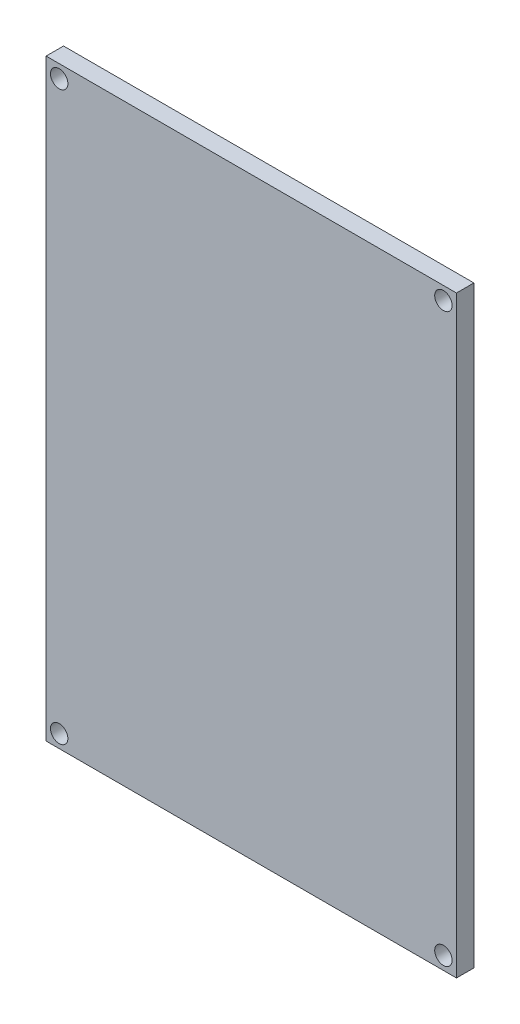
ISO-10303-21;
HEADER;
FILE_DESCRIPTION(('STEP AP214'),'2;1');
FILE_NAME('part.step','',(''),(''),'','','');
FILE_SCHEMA(('AUTOMOTIVE_DESIGN { 1 0 10303 214 1 1 1 1 }'));
ENDSEC;
DATA;
#1=APPLICATION_CONTEXT('core data for automotive mechanical design processes');
#2=APPLICATION_PROTOCOL_DEFINITION('international standard','automotive_design',2000,#1);
#3=PRODUCT_CONTEXT('',#1,'mechanical');
#4=PRODUCT('Part','Part','',(#3));
#5=PRODUCT_RELATED_PRODUCT_CATEGORY('part','',(#4));
#6=PRODUCT_DEFINITION_FORMATION('','',#4);
#7=PRODUCT_DEFINITION_CONTEXT('part definition',#1,'design');
#8=PRODUCT_DEFINITION('design','',#6,#7);
#9=PRODUCT_DEFINITION_SHAPE('','',#8);
#10=(LENGTH_UNIT() NAMED_UNIT(*) SI_UNIT(.MILLI.,.METRE.));
#11=(NAMED_UNIT(*) PLANE_ANGLE_UNIT() SI_UNIT($,.RADIAN.));
#12=(NAMED_UNIT(*) SI_UNIT($,.STERADIAN.) SOLID_ANGLE_UNIT());
#13=UNCERTAINTY_MEASURE_WITH_UNIT(LENGTH_MEASURE(1.E-05),#10,'distance_accuracy_value','');
#14=(GEOMETRIC_REPRESENTATION_CONTEXT(3) GLOBAL_UNCERTAINTY_ASSIGNED_CONTEXT((#13)) GLOBAL_UNIT_ASSIGNED_CONTEXT((#10,
#11,#12)) REPRESENTATION_CONTEXT('',''));
#15=CARTESIAN_POINT('',(0.,0.,0.));
#16=DIRECTION('',(0.,0.,1.));
#17=DIRECTION('',(1.,0.,0.));
#18=AXIS2_PLACEMENT_3D('',#15,#16,#17);
#19=CARTESIAN_POINT('',(0.,0.,3.));
#20=DIRECTION('',(0.,1.,0.));
#21=DIRECTION('',(-1.,0.,0.));
#22=AXIS2_PLACEMENT_3D('',#19,#20,#21);
#23=PLANE('',#22);
#24=DIRECTION('',(1.,0.,0.));
#25=VECTOR('',#24,1.);
#26=CARTESIAN_POINT('',(0.,0.,0.));
#27=LINE('',#26,#25);
#28=CARTESIAN_POINT('',(0.,0.,0.));
#29=VERTEX_POINT('',#28);
#30=CARTESIAN_POINT('',(70.6819805153395,0.,0.));
#31=VERTEX_POINT('',#30);
#32=EDGE_CURVE('E113',#29,#31,#27,.T.);
#33=ORIENTED_EDGE('',*,*,#32,.T.);
#34=DIRECTION('',(0.,0.,-1.));
#35=VECTOR('',#34,1.);
#36=CARTESIAN_POINT('',(70.6819805153395,0.,3.));
#37=LINE('',#36,#35);
#38=CARTESIAN_POINT('',(70.6819805153395,0.,3.));
#39=VERTEX_POINT('',#38);
#40=EDGE_CURVE('E11',#39,#31,#37,.T.);
#41=ORIENTED_EDGE('',*,*,#40,.F.);
#42=DIRECTION('',(1.,0.,0.));
#43=VECTOR('',#42,1.);
#44=CARTESIAN_POINT('',(0.,0.,3.));
#45=LINE('',#44,#43);
#46=CARTESIAN_POINT('',(0.,0.,3.));
#47=VERTEX_POINT('',#46);
#48=EDGE_CURVE('E86',#47,#39,#45,.T.);
#49=ORIENTED_EDGE('',*,*,#48,.F.);
#50=DIRECTION('',(0.,0.,-1.));
#51=VECTOR('',#50,1.);
#52=CARTESIAN_POINT('',(0.,0.,3.));
#53=LINE('',#52,#51);
#54=EDGE_CURVE('E52',#47,#29,#53,.T.);
#55=ORIENTED_EDGE('',*,*,#54,.T.);
#56=EDGE_LOOP('',(#33,#41,#49,#55));
#57=FACE_BOUND('',#56,.T.);
#58=ADVANCED_FACE('F35',(#57),#23,.F.);
#59=CARTESIAN_POINT('',(70.6819805153395,0.,3.));
#60=DIRECTION('',(-1.,0.,0.));
#61=DIRECTION('',(0.,-1.,0.));
#62=AXIS2_PLACEMENT_3D('',#59,#60,#61);
#63=PLANE('',#62);
#64=DIRECTION('',(0.,1.,0.));
#65=VECTOR('',#64,1.);
#66=CARTESIAN_POINT('',(70.6819805153395,0.,0.));
#67=LINE('',#66,#65);
#68=CARTESIAN_POINT('',(70.6819805153395,102.181980515339,0.));
#69=VERTEX_POINT('',#68);
#70=EDGE_CURVE('E91',#31,#69,#67,.T.);
#71=ORIENTED_EDGE('',*,*,#70,.T.);
#72=DIRECTION('',(0.,0.,-1.));
#73=VECTOR('',#72,1.);
#74=CARTESIAN_POINT('',(70.6819805153395,102.181980515339,3.));
#75=LINE('',#74,#73);
#76=CARTESIAN_POINT('',(70.6819805153395,102.181980515339,3.));
#77=VERTEX_POINT('',#76);
#78=EDGE_CURVE('E44',#77,#69,#75,.T.);
#79=ORIENTED_EDGE('',*,*,#78,.F.);
#80=DIRECTION('',(0.,1.,0.));
#81=VECTOR('',#80,1.);
#82=CARTESIAN_POINT('',(70.6819805153395,0.,3.));
#83=LINE('',#82,#81);
#84=EDGE_CURVE('E77',#39,#77,#83,.T.);
#85=ORIENTED_EDGE('',*,*,#84,.F.);
#86=ORIENTED_EDGE('',*,*,#40,.T.);
#87=EDGE_LOOP('',(#71,#79,#85,#86));
#88=FACE_BOUND('',#87,.T.);
#89=ADVANCED_FACE('F90',(#88),#63,.F.);
#90=CARTESIAN_POINT('',(0.,102.181980515339,3.));
#91=DIRECTION('',(0.,1.,0.));
#92=DIRECTION('',(-1.,0.,0.));
#93=AXIS2_PLACEMENT_3D('',#90,#91,#92);
#94=PLANE('',#93);
#95=DIRECTION('',(1.,0.,0.));
#96=VECTOR('',#95,1.);
#97=CARTESIAN_POINT('',(0.,102.181980515339,0.));
#98=LINE('',#97,#96);
#99=CARTESIAN_POINT('',(0.,102.181980515339,0.));
#100=VERTEX_POINT('',#99);
#101=EDGE_CURVE('E116',#100,#69,#98,.T.);
#102=ORIENTED_EDGE('',*,*,#101,.F.);
#103=DIRECTION('',(0.,0.,-1.));
#104=VECTOR('',#103,1.);
#105=CARTESIAN_POINT('',(0.,102.181980515339,3.));
#106=LINE('',#105,#104);
#107=CARTESIAN_POINT('',(0.,102.181980515339,3.));
#108=VERTEX_POINT('',#107);
#109=EDGE_CURVE('E66',#108,#100,#106,.T.);
#110=ORIENTED_EDGE('',*,*,#109,.F.);
#111=DIRECTION('',(1.,0.,0.));
#112=VECTOR('',#111,1.);
#113=CARTESIAN_POINT('',(0.,102.181980515339,3.));
#114=LINE('',#113,#112);
#115=EDGE_CURVE('E85',#108,#77,#114,.T.);
#116=ORIENTED_EDGE('',*,*,#115,.T.);
#117=ORIENTED_EDGE('',*,*,#78,.T.);
#118=EDGE_LOOP('',(#102,#110,#116,#117));
#119=FACE_BOUND('',#118,.T.);
#120=ADVANCED_FACE('F94',(#119),#94,.T.);
#121=CARTESIAN_POINT('',(0.,0.,3.));
#122=DIRECTION('',(-1.,0.,0.));
#123=DIRECTION('',(0.,-1.,0.));
#124=AXIS2_PLACEMENT_3D('',#121,#122,#123);
#125=PLANE('',#124);
#126=DIRECTION('',(0.,1.,0.));
#127=VECTOR('',#126,1.);
#128=CARTESIAN_POINT('',(0.,0.,0.));
#129=LINE('',#128,#127);
#130=EDGE_CURVE('E118',#29,#100,#129,.T.);
#131=ORIENTED_EDGE('',*,*,#130,.F.);
#132=ORIENTED_EDGE('',*,*,#54,.F.);
#133=DIRECTION('',(0.,1.,0.));
#134=VECTOR('',#133,1.);
#135=CARTESIAN_POINT('',(0.,0.,3.));
#136=LINE('',#135,#134);
#137=EDGE_CURVE('E95',#47,#108,#136,.T.);
#138=ORIENTED_EDGE('',*,*,#137,.T.);
#139=ORIENTED_EDGE('',*,*,#109,.T.);
#140=EDGE_LOOP('',(#131,#132,#138,#139));
#141=FACE_BOUND('',#140,.T.);
#142=ADVANCED_FACE('F172',(#141),#125,.T.);
#143=CARTESIAN_POINT('',(2.25,2.25,3.));
#144=DIRECTION('',(0.,0.,-1.));
#145=DIRECTION('',(-1.,0.,0.));
#146=AXIS2_PLACEMENT_3D('',#143,#144,#145);
#147=CYLINDRICAL_SURFACE('',#146,1.5);
#148=CARTESIAN_POINT('',(2.25,2.25,3.));
#149=DIRECTION('',(0.,0.,1.));
#150=DIRECTION('',(1.,0.,0.));
#151=AXIS2_PLACEMENT_3D('',#148,#149,#150);
#152=CIRCLE('',#151,1.5);
#153=CARTESIAN_POINT('',(3.75,2.25,3.));
#154=VERTEX_POINT('',#153);
#155=EDGE_CURVE('E134',#154,#154,#152,.T.);
#156=ORIENTED_EDGE('',*,*,#155,.T.);
#157=EDGE_LOOP('',(#156));
#158=FACE_BOUND('',#157,.T.);
#159=CARTESIAN_POINT('',(2.25,2.25,0.));
#160=DIRECTION('',(0.,0.,1.));
#161=DIRECTION('',(1.,0.,0.));
#162=AXIS2_PLACEMENT_3D('',#159,#160,#161);
#163=CIRCLE('',#162,1.5);
#164=CARTESIAN_POINT('',(3.75,2.25,0.));
#165=VERTEX_POINT('',#164);
#166=EDGE_CURVE('E110',#165,#165,#163,.T.);
#167=ORIENTED_EDGE('',*,*,#166,.F.);
#168=EDGE_LOOP('',(#167));
#169=FACE_BOUND('',#168,.T.);
#170=ADVANCED_FACE('F143',(#158,#169),#147,.F.);
#171=CARTESIAN_POINT('',(68.4319805153395,2.25,3.));
#172=DIRECTION('',(0.,0.,-1.));
#173=DIRECTION('',(-1.,0.,0.));
#174=AXIS2_PLACEMENT_3D('',#171,#172,#173);
#175=CYLINDRICAL_SURFACE('',#174,1.5);
#176=CARTESIAN_POINT('',(68.4319805153395,2.25,3.));
#177=DIRECTION('',(0.,0.,1.));
#178=DIRECTION('',(1.,0.,0.));
#179=AXIS2_PLACEMENT_3D('',#176,#177,#178);
#180=CIRCLE('',#179,1.5);
#181=CARTESIAN_POINT('',(69.9319805153395,2.25,3.));
#182=VERTEX_POINT('',#181);
#183=EDGE_CURVE('E129',#182,#182,#180,.F.);
#184=ORIENTED_EDGE('',*,*,#183,.F.);
#185=EDGE_LOOP('',(#184));
#186=FACE_BOUND('',#185,.T.);
#187=CARTESIAN_POINT('',(68.4319805153395,2.25,0.));
#188=DIRECTION('',(0.,0.,1.));
#189=DIRECTION('',(1.,0.,0.));
#190=AXIS2_PLACEMENT_3D('',#187,#188,#189);
#191=CIRCLE('',#190,1.5);
#192=CARTESIAN_POINT('',(69.9319805153395,2.25,0.));
#193=VERTEX_POINT('',#192);
#194=EDGE_CURVE('E106',#193,#193,#191,.F.);
#195=ORIENTED_EDGE('',*,*,#194,.T.);
#196=EDGE_LOOP('',(#195));
#197=FACE_BOUND('',#196,.T.);
#198=ADVANCED_FACE('F171',(#186,#197),#175,.F.);
#199=CARTESIAN_POINT('',(68.4319805153395,99.9319805153395,3.));
#200=DIRECTION('',(0.,0.,-1.));
#201=DIRECTION('',(-1.,0.,0.));
#202=AXIS2_PLACEMENT_3D('',#199,#200,#201);
#203=CYLINDRICAL_SURFACE('',#202,1.5);
#204=CARTESIAN_POINT('',(68.4319805153395,99.9319805153395,3.));
#205=DIRECTION('',(0.,0.,1.));
#206=DIRECTION('',(1.,0.,0.));
#207=AXIS2_PLACEMENT_3D('',#204,#205,#206);
#208=CIRCLE('',#207,1.5);
#209=CARTESIAN_POINT('',(69.9319805153395,99.9319805153395,3.));
#210=VERTEX_POINT('',#209);
#211=EDGE_CURVE('E124',#210,#210,#208,.T.);
#212=ORIENTED_EDGE('',*,*,#211,.T.);
#213=EDGE_LOOP('',(#212));
#214=FACE_BOUND('',#213,.T.);
#215=CARTESIAN_POINT('',(68.4319805153395,99.9319805153395,0.));
#216=DIRECTION('',(0.,0.,1.));
#217=DIRECTION('',(1.,0.,0.));
#218=AXIS2_PLACEMENT_3D('',#215,#216,#217);
#219=CIRCLE('',#218,1.5);
#220=CARTESIAN_POINT('',(69.9319805153395,99.9319805153395,0.));
#221=VERTEX_POINT('',#220);
#222=EDGE_CURVE('E103',#221,#221,#219,.T.);
#223=ORIENTED_EDGE('',*,*,#222,.F.);
#224=EDGE_LOOP('',(#223));
#225=FACE_BOUND('',#224,.T.);
#226=ADVANCED_FACE('F37',(#214,#225),#203,.F.);
#227=CARTESIAN_POINT('',(2.25,99.9319805153395,3.));
#228=DIRECTION('',(0.,0.,-1.));
#229=DIRECTION('',(-1.,0.,0.));
#230=AXIS2_PLACEMENT_3D('',#227,#228,#229);
#231=CYLINDRICAL_SURFACE('',#230,1.5);
#232=CARTESIAN_POINT('',(2.25,99.9319805153395,3.));
#233=DIRECTION('',(0.,0.,1.));
#234=DIRECTION('',(1.,0.,0.));
#235=AXIS2_PLACEMENT_3D('',#232,#233,#234);
#236=CIRCLE('',#235,1.5);
#237=CARTESIAN_POINT('',(3.75,99.9319805153395,3.));
#238=VERTEX_POINT('',#237);
#239=EDGE_CURVE('E97',#238,#238,#236,.F.);
#240=ORIENTED_EDGE('',*,*,#239,.F.);
#241=EDGE_LOOP('',(#240));
#242=FACE_BOUND('',#241,.T.);
#243=CARTESIAN_POINT('',(2.25,99.9319805153395,0.));
#244=DIRECTION('',(0.,0.,1.));
#245=DIRECTION('',(1.,0.,0.));
#246=AXIS2_PLACEMENT_3D('',#243,#244,#245);
#247=CIRCLE('',#246,1.5);
#248=CARTESIAN_POINT('',(3.75,99.9319805153395,0.));
#249=VERTEX_POINT('',#248);
#250=EDGE_CURVE('E121',#249,#249,#247,.F.);
#251=ORIENTED_EDGE('',*,*,#250,.T.);
#252=EDGE_LOOP('',(#251));
#253=FACE_BOUND('',#252,.T.);
#254=ADVANCED_FACE('F148',(#242,#253),#231,.F.);
#255=CARTESIAN_POINT('',(0.,0.,3.));
#256=DIRECTION('',(0.,0.,1.));
#257=DIRECTION('',(1.,0.,0.));
#258=AXIS2_PLACEMENT_3D('',#255,#256,#257);
#259=PLANE('',#258);
#260=ORIENTED_EDGE('',*,*,#211,.F.);
#261=EDGE_LOOP('',(#260));
#262=FACE_BOUND('',#261,.T.);
#263=ORIENTED_EDGE('',*,*,#183,.T.);
#264=EDGE_LOOP('',(#263));
#265=FACE_BOUND('',#264,.T.);
#266=ORIENTED_EDGE('',*,*,#155,.F.);
#267=EDGE_LOOP('',(#266));
#268=FACE_BOUND('',#267,.T.);
#269=ORIENTED_EDGE('',*,*,#48,.T.);
#270=ORIENTED_EDGE('',*,*,#84,.T.);
#271=ORIENTED_EDGE('',*,*,#115,.F.);
#272=ORIENTED_EDGE('',*,*,#137,.F.);
#273=EDGE_LOOP('',(#269,#270,#271,#272));
#274=FACE_BOUND('',#273,.T.);
#275=ORIENTED_EDGE('',*,*,#239,.T.);
#276=EDGE_LOOP('',(#275));
#277=FACE_BOUND('',#276,.T.);
#278=ADVANCED_FACE('F81',(#262,#265,#268,#274,#277),#259,.T.);
#279=CARTESIAN_POINT('',(0.,0.,0.));
#280=DIRECTION('',(0.,0.,1.));
#281=DIRECTION('',(1.,0.,0.));
#282=AXIS2_PLACEMENT_3D('',#279,#280,#281);
#283=PLANE('',#282);
#284=CARTESIAN_POINT('',(22.,72.,0.));
#285=DIRECTION('',(0.,0.,1.));
#286=DIRECTION('',(1.,0.,0.));
#287=AXIS2_PLACEMENT_3D('',#284,#285,#286);
#288=CIRCLE('',#287,2.23606797749979);
#289=CARTESIAN_POINT('',(24.2360679774998,72.,0.));
#290=VERTEX_POINT('',#289);
#291=EDGE_CURVE('E302',#290,#290,#288,.T.);
#292=ORIENTED_EDGE('',*,*,#291,.T.);
#293=EDGE_LOOP('',(#292));
#294=FACE_BOUND('',#293,.T.);
#295=CARTESIAN_POINT('',(50.,73.,0.));
#296=DIRECTION('',(0.,0.,1.));
#297=DIRECTION('',(1.,0.,0.));
#298=AXIS2_PLACEMENT_3D('',#295,#296,#297);
#299=CIRCLE('',#298,1.41421356237309);
#300=CARTESIAN_POINT('',(51.4142135623731,73.,0.));
#301=VERTEX_POINT('',#300);
#302=EDGE_CURVE('E301',#301,#301,#299,.T.);
#303=ORIENTED_EDGE('',*,*,#302,.T.);
#304=EDGE_LOOP('',(#303));
#305=FACE_BOUND('',#304,.T.);
#306=CARTESIAN_POINT('',(35.,21.,0.));
#307=DIRECTION('',(0.,0.,1.));
#308=DIRECTION('',(1.,0.,0.));
#309=AXIS2_PLACEMENT_3D('',#306,#307,#308);
#310=CIRCLE('',#309,2.23606797749979);
#311=CARTESIAN_POINT('',(37.2360679774998,21.,0.));
#312=VERTEX_POINT('',#311);
#313=EDGE_CURVE('E137',#312,#312,#310,.T.);
#314=ORIENTED_EDGE('',*,*,#313,.T.);
#315=EDGE_LOOP('',(#314));
#316=FACE_BOUND('',#315,.T.);
#317=ORIENTED_EDGE('',*,*,#222,.T.);
#318=EDGE_LOOP('',(#317));
#319=FACE_BOUND('',#318,.T.);
#320=ORIENTED_EDGE('',*,*,#194,.F.);
#321=EDGE_LOOP('',(#320));
#322=FACE_BOUND('',#321,.T.);
#323=ORIENTED_EDGE('',*,*,#166,.T.);
#324=EDGE_LOOP('',(#323));
#325=FACE_BOUND('',#324,.T.);
#326=ORIENTED_EDGE('',*,*,#32,.F.);
#327=ORIENTED_EDGE('',*,*,#130,.T.);
#328=ORIENTED_EDGE('',*,*,#101,.T.);
#329=ORIENTED_EDGE('',*,*,#70,.F.);
#330=EDGE_LOOP('',(#326,#327,#328,#329));
#331=FACE_BOUND('',#330,.T.);
#332=ORIENTED_EDGE('',*,*,#250,.F.);
#333=EDGE_LOOP('',(#332));
#334=FACE_BOUND('',#333,.T.);
#335=ADVANCED_FACE('F147',(#294,#305,#316,#319,#322,#325,#331,#334),#283,.F.);
#336=CARTESIAN_POINT('',(35.,21.,-14.35));
#337=DIRECTION('',(0.,0.,1.));
#338=DIRECTION('',(1.,0.,0.));
#339=AXIS2_PLACEMENT_3D('',#336,#337,#338);
#340=CYLINDRICAL_SURFACE('',#339,2.23606797749979);
#341=CARTESIAN_POINT('',(35.,21.,-14.35));
#342=DIRECTION('',(0.,0.,1.));
#343=DIRECTION('',(1.,0.,0.));
#344=AXIS2_PLACEMENT_3D('',#341,#342,#343);
#345=CIRCLE('',#344,2.23606797749979);
#346=CARTESIAN_POINT('',(37.2360679774998,21.,-14.35));
#347=VERTEX_POINT('',#346);
#348=EDGE_CURVE('E107',#347,#347,#345,.T.);
#349=ORIENTED_EDGE('',*,*,#348,.T.);
#350=EDGE_LOOP('',(#349));
#351=FACE_BOUND('',#350,.T.);
#352=ORIENTED_EDGE('',*,*,#313,.F.);
#353=EDGE_LOOP('',(#352));
#354=FACE_BOUND('',#353,.T.);
#355=ADVANCED_FACE('F155',(#351,#354),#340,.T.);
#356=CARTESIAN_POINT('',(0.,0.,-14.35));
#357=DIRECTION('',(0.,0.,1.));
#358=DIRECTION('',(1.,0.,0.));
#359=AXIS2_PLACEMENT_3D('',#356,#357,#358);
#360=PLANE('',#359);
#361=ORIENTED_EDGE('',*,*,#348,.F.);
#362=EDGE_LOOP('',(#361));
#363=FACE_BOUND('',#362,.T.);
#364=ADVANCED_FACE('F245',(#363),#360,.F.);
#365=CARTESIAN_POINT('',(50.,73.,-14.35));
#366=DIRECTION('',(0.,0.,1.));
#367=DIRECTION('',(1.,0.,0.));
#368=AXIS2_PLACEMENT_3D('',#365,#366,#367);
#369=CYLINDRICAL_SURFACE('',#368,1.41421356237309);
#370=CARTESIAN_POINT('',(50.,73.,-14.35));
#371=DIRECTION('',(0.,0.,1.));
#372=DIRECTION('',(1.,0.,0.));
#373=AXIS2_PLACEMENT_3D('',#370,#371,#372);
#374=CIRCLE('',#373,1.41421356237309);
#375=CARTESIAN_POINT('',(51.4142135623731,73.,-14.35));
#376=VERTEX_POINT('',#375);
#377=EDGE_CURVE('E305',#376,#376,#374,.T.);
#378=ORIENTED_EDGE('',*,*,#377,.T.);
#379=EDGE_LOOP('',(#378));
#380=FACE_BOUND('',#379,.T.);
#381=ORIENTED_EDGE('',*,*,#302,.F.);
#382=EDGE_LOOP('',(#381));
#383=FACE_BOUND('',#382,.T.);
#384=ADVANCED_FACE('F253',(#380,#383),#369,.T.);
#385=CARTESIAN_POINT('',(0.,0.,-14.35));
#386=DIRECTION('',(0.,0.,1.));
#387=DIRECTION('',(1.,0.,0.));
#388=AXIS2_PLACEMENT_3D('',#385,#386,#387);
#389=PLANE('',#388);
#390=ORIENTED_EDGE('',*,*,#377,.F.);
#391=EDGE_LOOP('',(#390));
#392=FACE_BOUND('',#391,.T.);
#393=ADVANCED_FACE('F262',(#392),#389,.F.);
#394=CARTESIAN_POINT('',(22.,72.,-14.35));
#395=DIRECTION('',(0.,0.,1.));
#396=DIRECTION('',(1.,0.,0.));
#397=AXIS2_PLACEMENT_3D('',#394,#395,#396);
#398=CYLINDRICAL_SURFACE('',#397,2.23606797749979);
#399=CARTESIAN_POINT('',(22.,72.,-14.35));
#400=DIRECTION('',(0.,0.,1.));
#401=DIRECTION('',(1.,0.,0.));
#402=AXIS2_PLACEMENT_3D('',#399,#400,#401);
#403=CIRCLE('',#402,2.23606797749979);
#404=CARTESIAN_POINT('',(24.2360679774998,72.,-14.35));
#405=VERTEX_POINT('',#404);
#406=EDGE_CURVE('E300',#405,#405,#403,.T.);
#407=ORIENTED_EDGE('',*,*,#406,.T.);
#408=EDGE_LOOP('',(#407));
#409=FACE_BOUND('',#408,.T.);
#410=ORIENTED_EDGE('',*,*,#291,.F.);
#411=EDGE_LOOP('',(#410));
#412=FACE_BOUND('',#411,.T.);
#413=ADVANCED_FACE('F271',(#409,#412),#398,.T.);
#414=CARTESIAN_POINT('',(0.,0.,-14.35));
#415=DIRECTION('',(0.,0.,1.));
#416=DIRECTION('',(1.,0.,0.));
#417=AXIS2_PLACEMENT_3D('',#414,#415,#416);
#418=PLANE('',#417);
#419=ORIENTED_EDGE('',*,*,#406,.F.);
#420=EDGE_LOOP('',(#419));
#421=FACE_BOUND('',#420,.T.);
#422=ADVANCED_FACE('F280',(#421),#418,.F.);
#423=CLOSED_SHELL('',(#58,#89,#120,#142,#170,#198,#226,#254,#278,#335,#355,#364,#384,#393,#413,#422));
#424=MANIFOLD_SOLID_BREP('B2',#423);
#425=ADVANCED_BREP_SHAPE_REPRESENTATION('',(#18,#424),#14);
#426=SHAPE_DEFINITION_REPRESENTATION(#9,#425);
ENDSEC;
END-ISO-10303-21;
